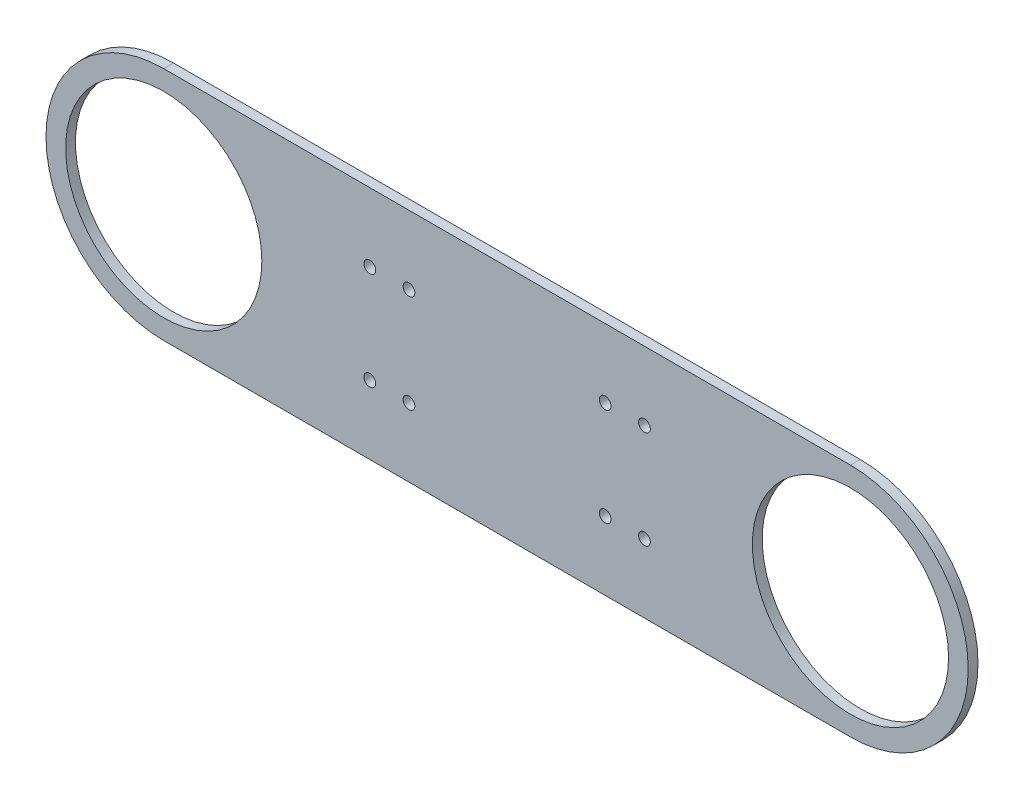
ISO-10303-21;
HEADER;
FILE_DESCRIPTION(('STEP AP214'),'2;1');
FILE_NAME('part.step','',(''),(''),'','','');
FILE_SCHEMA(('AUTOMOTIVE_DESIGN { 1 0 10303 214 1 1 1 1 }'));
ENDSEC;
DATA;
#1=APPLICATION_CONTEXT('core data for automotive mechanical design processes');
#2=APPLICATION_PROTOCOL_DEFINITION('international standard','automotive_design',2000,#1);
#3=PRODUCT_CONTEXT('',#1,'mechanical');
#4=PRODUCT('Part','Part','',(#3));
#5=PRODUCT_RELATED_PRODUCT_CATEGORY('part','',(#4));
#6=PRODUCT_DEFINITION_FORMATION('','',#4);
#7=PRODUCT_DEFINITION_CONTEXT('part definition',#1,'design');
#8=PRODUCT_DEFINITION('design','',#6,#7);
#9=PRODUCT_DEFINITION_SHAPE('','',#8);
#10=(LENGTH_UNIT() NAMED_UNIT(*) SI_UNIT(.MILLI.,.METRE.));
#11=(NAMED_UNIT(*) PLANE_ANGLE_UNIT() SI_UNIT($,.RADIAN.));
#12=(NAMED_UNIT(*) SI_UNIT($,.STERADIAN.) SOLID_ANGLE_UNIT());
#13=UNCERTAINTY_MEASURE_WITH_UNIT(LENGTH_MEASURE(1.E-05),#10,'distance_accuracy_value','');
#14=(GEOMETRIC_REPRESENTATION_CONTEXT(3) GLOBAL_UNCERTAINTY_ASSIGNED_CONTEXT((#13)) GLOBAL_UNIT_ASSIGNED_CONTEXT((#10,
#11,#12)) REPRESENTATION_CONTEXT('',''));
#15=CARTESIAN_POINT('',(0.,0.,0.));
#16=DIRECTION('',(0.,0.,1.));
#17=DIRECTION('',(1.,0.,0.));
#18=AXIS2_PLACEMENT_3D('',#15,#16,#17);
#19=CARTESIAN_POINT('',(0.,0.,-5.));
#20=DIRECTION('',(0.,0.,1.));
#21=DIRECTION('',(1.,0.,0.));
#22=AXIS2_PLACEMENT_3D('',#19,#20,#21);
#23=CYLINDRICAL_SURFACE('',#22,60.);
#24=CARTESIAN_POINT('',(0.,0.,0.));
#25=DIRECTION('',(0.,0.,1.));
#26=DIRECTION('',(1.,0.,0.));
#27=AXIS2_PLACEMENT_3D('',#24,#25,#26);
#28=CIRCLE('',#27,60.);
#29=CARTESIAN_POINT('',(0.,60.,0.));
#30=VERTEX_POINT('',#29);
#31=CARTESIAN_POINT('',(0.,-60.,0.));
#32=VERTEX_POINT('',#31);
#33=EDGE_CURVE('E106',#30,#32,#28,.T.);
#34=ORIENTED_EDGE('',*,*,#33,.F.);
#35=DIRECTION('',(0.,0.,1.));
#36=VECTOR('',#35,1.);
#37=CARTESIAN_POINT('',(0.,60.,-5.));
#38=LINE('',#37,#36);
#39=CARTESIAN_POINT('',(0.,60.,-5.));
#40=VERTEX_POINT('',#39);
#41=EDGE_CURVE('E11',#40,#30,#38,.T.);
#42=ORIENTED_EDGE('',*,*,#41,.F.);
#43=CARTESIAN_POINT('',(0.,0.,-5.));
#44=DIRECTION('',(0.,0.,1.));
#45=DIRECTION('',(1.,0.,0.));
#46=AXIS2_PLACEMENT_3D('',#43,#44,#45);
#47=CIRCLE('',#46,60.);
#48=CARTESIAN_POINT('',(0.,-60.,-5.));
#49=VERTEX_POINT('',#48);
#50=EDGE_CURVE('E99',#40,#49,#47,.T.);
#51=ORIENTED_EDGE('',*,*,#50,.T.);
#52=DIRECTION('',(0.,0.,1.));
#53=VECTOR('',#52,1.);
#54=CARTESIAN_POINT('',(0.,-60.,-5.));
#55=LINE('',#54,#53);
#56=EDGE_CURVE('E44',#49,#32,#55,.T.);
#57=ORIENTED_EDGE('',*,*,#56,.T.);
#58=EDGE_LOOP('',(#34,#42,#51,#57));
#59=FACE_BOUND('',#58,.T.);
#60=ADVANCED_FACE('F41',(#59),#23,.T.);
#61=CARTESIAN_POINT('',(0.,60.,-5.));
#62=DIRECTION('',(0.,1.,0.));
#63=DIRECTION('',(-1.,0.,0.));
#64=AXIS2_PLACEMENT_3D('',#61,#62,#63);
#65=PLANE('',#64);
#66=DIRECTION('',(-1.,0.,0.));
#67=VECTOR('',#66,1.);
#68=CARTESIAN_POINT('',(0.,60.,0.));
#69=LINE('',#68,#67);
#70=CARTESIAN_POINT('',(350.,60.,0.));
#71=VERTEX_POINT('',#70);
#72=EDGE_CURVE('E101',#71,#30,#69,.T.);
#73=ORIENTED_EDGE('',*,*,#72,.F.);
#74=DIRECTION('',(0.,0.,1.));
#75=VECTOR('',#74,1.);
#76=CARTESIAN_POINT('',(350.,60.,-5.));
#77=LINE('',#76,#75);
#78=CARTESIAN_POINT('',(350.,60.,-5.));
#79=VERTEX_POINT('',#78);
#80=EDGE_CURVE('E50',#79,#71,#77,.T.);
#81=ORIENTED_EDGE('',*,*,#80,.F.);
#82=DIRECTION('',(-1.,0.,0.));
#83=VECTOR('',#82,1.);
#84=CARTESIAN_POINT('',(0.,60.,-5.));
#85=LINE('',#84,#83);
#86=EDGE_CURVE('E96',#79,#40,#85,.T.);
#87=ORIENTED_EDGE('',*,*,#86,.T.);
#88=ORIENTED_EDGE('',*,*,#41,.T.);
#89=EDGE_LOOP('',(#73,#81,#87,#88));
#90=FACE_BOUND('',#89,.T.);
#91=ADVANCED_FACE('F117',(#90),#65,.T.);
#92=CARTESIAN_POINT('',(350.,0.,-5.));
#93=DIRECTION('',(0.,0.,1.));
#94=DIRECTION('',(1.,0.,0.));
#95=AXIS2_PLACEMENT_3D('',#92,#93,#94);
#96=CYLINDRICAL_SURFACE('',#95,60.);
#97=CARTESIAN_POINT('',(350.,0.,0.));
#98=DIRECTION('',(0.,0.,1.));
#99=DIRECTION('',(1.,0.,0.));
#100=AXIS2_PLACEMENT_3D('',#97,#98,#99);
#101=CIRCLE('',#100,60.);
#102=CARTESIAN_POINT('',(350.,-60.,0.));
#103=VERTEX_POINT('',#102);
#104=EDGE_CURVE('E91',#103,#71,#101,.T.);
#105=ORIENTED_EDGE('',*,*,#104,.F.);
#106=DIRECTION('',(0.,0.,1.));
#107=VECTOR('',#106,1.);
#108=CARTESIAN_POINT('',(350.,-60.,-5.));
#109=LINE('',#108,#107);
#110=CARTESIAN_POINT('',(350.,-60.,-5.));
#111=VERTEX_POINT('',#110);
#112=EDGE_CURVE('E86',#111,#103,#109,.T.);
#113=ORIENTED_EDGE('',*,*,#112,.F.);
#114=CARTESIAN_POINT('',(350.,0.,-5.));
#115=DIRECTION('',(0.,0.,1.));
#116=DIRECTION('',(1.,0.,0.));
#117=AXIS2_PLACEMENT_3D('',#114,#115,#116);
#118=CIRCLE('',#117,60.);
#119=EDGE_CURVE('E89',#111,#79,#118,.T.);
#120=ORIENTED_EDGE('',*,*,#119,.T.);
#121=ORIENTED_EDGE('',*,*,#80,.T.);
#122=EDGE_LOOP('',(#105,#113,#120,#121));
#123=FACE_BOUND('',#122,.T.);
#124=ADVANCED_FACE('F88',(#123),#96,.T.);
#125=CARTESIAN_POINT('',(0.,-60.,-5.));
#126=DIRECTION('',(0.,-1.,0.));
#127=DIRECTION('',(1.,0.,0.));
#128=AXIS2_PLACEMENT_3D('',#125,#126,#127);
#129=PLANE('',#128);
#130=DIRECTION('',(1.,0.,0.));
#131=VECTOR('',#130,1.);
#132=CARTESIAN_POINT('',(0.,-60.,0.));
#133=LINE('',#132,#131);
#134=EDGE_CURVE('E109',#32,#103,#133,.T.);
#135=ORIENTED_EDGE('',*,*,#134,.F.);
#136=ORIENTED_EDGE('',*,*,#56,.F.);
#137=DIRECTION('',(1.,0.,0.));
#138=VECTOR('',#137,1.);
#139=CARTESIAN_POINT('',(0.,-60.,-5.));
#140=LINE('',#139,#138);
#141=EDGE_CURVE('E95',#49,#111,#140,.T.);
#142=ORIENTED_EDGE('',*,*,#141,.T.);
#143=ORIENTED_EDGE('',*,*,#112,.T.);
#144=EDGE_LOOP('',(#135,#136,#142,#143));
#145=FACE_BOUND('',#144,.T.);
#146=ADVANCED_FACE('F98',(#145),#129,.T.);
#147=CARTESIAN_POINT('',(0.,0.,-5.));
#148=DIRECTION('',(0.,0.,1.));
#149=DIRECTION('',(1.,0.,0.));
#150=AXIS2_PLACEMENT_3D('',#147,#148,#149);
#151=PLANE('',#150);
#152=CARTESIAN_POINT('',(125.,-25.,-5.));
#153=DIRECTION('',(0.,0.,1.));
#154=DIRECTION('',(1.,0.,0.));
#155=AXIS2_PLACEMENT_3D('',#152,#153,#154);
#156=CIRCLE('',#155,2.99999999999999);
#157=CARTESIAN_POINT('',(128.,-25.,-5.));
#158=VERTEX_POINT('',#157);
#159=EDGE_CURVE('E185',#158,#158,#156,.T.);
#160=ORIENTED_EDGE('',*,*,#159,.T.);
#161=EDGE_LOOP('',(#160));
#162=FACE_BOUND('',#161,.T.);
#163=CARTESIAN_POINT('',(105.,-25.,-5.));
#164=DIRECTION('',(0.,0.,1.));
#165=DIRECTION('',(1.,0.,0.));
#166=AXIS2_PLACEMENT_3D('',#163,#164,#165);
#167=CIRCLE('',#166,2.99999999999999);
#168=CARTESIAN_POINT('',(108.,-25.,-5.));
#169=VERTEX_POINT('',#168);
#170=EDGE_CURVE('E187',#169,#169,#167,.T.);
#171=ORIENTED_EDGE('',*,*,#170,.T.);
#172=EDGE_LOOP('',(#171));
#173=FACE_BOUND('',#172,.T.);
#174=CARTESIAN_POINT('',(125.,25.,-5.));
#175=DIRECTION('',(0.,0.,1.));
#176=DIRECTION('',(1.,0.,0.));
#177=AXIS2_PLACEMENT_3D('',#174,#175,#176);
#178=CIRCLE('',#177,2.99999999999999);
#179=CARTESIAN_POINT('',(128.,25.,-5.));
#180=VERTEX_POINT('',#179);
#181=EDGE_CURVE('E201',#180,#180,#178,.F.);
#182=ORIENTED_EDGE('',*,*,#181,.F.);
#183=EDGE_LOOP('',(#182));
#184=FACE_BOUND('',#183,.T.);
#185=CARTESIAN_POINT('',(105.,25.,-5.));
#186=DIRECTION('',(0.,0.,1.));
#187=DIRECTION('',(1.,0.,0.));
#188=AXIS2_PLACEMENT_3D('',#185,#186,#187);
#189=CIRCLE('',#188,2.99999999999999);
#190=CARTESIAN_POINT('',(108.,25.,-5.));
#191=VERTEX_POINT('',#190);
#192=EDGE_CURVE('E197',#191,#191,#189,.F.);
#193=ORIENTED_EDGE('',*,*,#192,.F.);
#194=EDGE_LOOP('',(#193));
#195=FACE_BOUND('',#194,.T.);
#196=CARTESIAN_POINT('',(225.,-25.,-5.));
#197=DIRECTION('',(0.,0.,1.));
#198=DIRECTION('',(1.,0.,0.));
#199=AXIS2_PLACEMENT_3D('',#196,#197,#198);
#200=CIRCLE('',#199,2.99999999999999);
#201=CARTESIAN_POINT('',(228.,-25.,-5.));
#202=VERTEX_POINT('',#201);
#203=EDGE_CURVE('E213',#202,#202,#200,.F.);
#204=ORIENTED_EDGE('',*,*,#203,.F.);
#205=EDGE_LOOP('',(#204));
#206=FACE_BOUND('',#205,.T.);
#207=CARTESIAN_POINT('',(245.,-25.,-5.));
#208=DIRECTION('',(0.,0.,1.));
#209=DIRECTION('',(1.,0.,0.));
#210=AXIS2_PLACEMENT_3D('',#207,#208,#209);
#211=CIRCLE('',#210,2.99999999999999);
#212=CARTESIAN_POINT('',(248.,-25.,-5.));
#213=VERTEX_POINT('',#212);
#214=EDGE_CURVE('E208',#213,#213,#211,.F.);
#215=ORIENTED_EDGE('',*,*,#214,.F.);
#216=EDGE_LOOP('',(#215));
#217=FACE_BOUND('',#216,.T.);
#218=CARTESIAN_POINT('',(225.,25.,-5.));
#219=DIRECTION('',(0.,0.,1.));
#220=DIRECTION('',(1.,0.,0.));
#221=AXIS2_PLACEMENT_3D('',#218,#219,#220);
#222=CIRCLE('',#221,2.99999999999999);
#223=CARTESIAN_POINT('',(228.,25.,-5.));
#224=VERTEX_POINT('',#223);
#225=EDGE_CURVE('E225',#224,#224,#222,.T.);
#226=ORIENTED_EDGE('',*,*,#225,.T.);
#227=EDGE_LOOP('',(#226));
#228=FACE_BOUND('',#227,.T.);
#229=CARTESIAN_POINT('',(245.,25.,-5.));
#230=DIRECTION('',(0.,0.,1.));
#231=DIRECTION('',(1.,0.,0.));
#232=AXIS2_PLACEMENT_3D('',#229,#230,#231);
#233=CIRCLE('',#232,2.99999999999999);
#234=CARTESIAN_POINT('',(248.,25.,-5.));
#235=VERTEX_POINT('',#234);
#236=EDGE_CURVE('E220',#235,#235,#233,.T.);
#237=ORIENTED_EDGE('',*,*,#236,.T.);
#238=EDGE_LOOP('',(#237));
#239=FACE_BOUND('',#238,.T.);
#240=CARTESIAN_POINT('',(350.,0.,-5.));
#241=DIRECTION('',(0.,0.,1.));
#242=DIRECTION('',(1.,0.,0.));
#243=AXIS2_PLACEMENT_3D('',#240,#241,#242);
#244=CIRCLE('',#243,50.);
#245=CARTESIAN_POINT('',(400.,0.,-5.));
#246=VERTEX_POINT('',#245);
#247=EDGE_CURVE('E229',#246,#246,#244,.T.);
#248=ORIENTED_EDGE('',*,*,#247,.T.);
#249=EDGE_LOOP('',(#248));
#250=FACE_BOUND('',#249,.T.);
#251=CARTESIAN_POINT('',(0.,0.,-5.));
#252=DIRECTION('',(0.,0.,1.));
#253=DIRECTION('',(1.,0.,0.));
#254=AXIS2_PLACEMENT_3D('',#251,#252,#253);
#255=CIRCLE('',#254,50.);
#256=CARTESIAN_POINT('',(50.,0.,-5.));
#257=VERTEX_POINT('',#256);
#258=EDGE_CURVE('E110',#257,#257,#255,.T.);
#259=ORIENTED_EDGE('',*,*,#258,.T.);
#260=EDGE_LOOP('',(#259));
#261=FACE_BOUND('',#260,.T.);
#262=ORIENTED_EDGE('',*,*,#50,.F.);
#263=ORIENTED_EDGE('',*,*,#86,.F.);
#264=ORIENTED_EDGE('',*,*,#119,.F.);
#265=ORIENTED_EDGE('',*,*,#141,.F.);
#266=EDGE_LOOP('',(#262,#263,#264,#265));
#267=FACE_BOUND('',#266,.T.);
#268=ADVANCED_FACE('F94',(#162,#173,#184,#195,#206,#217,#228,#239,#250,#261,#267),#151,.F.);
#269=CARTESIAN_POINT('',(0.,0.,0.));
#270=DIRECTION('',(0.,0.,1.));
#271=DIRECTION('',(1.,0.,0.));
#272=AXIS2_PLACEMENT_3D('',#269,#270,#271);
#273=PLANE('',#272);
#274=CARTESIAN_POINT('',(125.,-25.,0.));
#275=DIRECTION('',(0.,0.,1.));
#276=DIRECTION('',(-1.,0.,0.));
#277=AXIS2_PLACEMENT_3D('',#274,#275,#276);
#278=CIRCLE('',#277,2.99999999999999);
#279=CARTESIAN_POINT('',(122.,-25.,0.));
#280=VERTEX_POINT('',#279);
#281=EDGE_CURVE('E183',#280,#280,#278,.T.);
#282=ORIENTED_EDGE('',*,*,#281,.F.);
#283=EDGE_LOOP('',(#282));
#284=FACE_BOUND('',#283,.T.);
#285=CARTESIAN_POINT('',(105.,-25.,0.));
#286=DIRECTION('',(0.,0.,1.));
#287=DIRECTION('',(-1.,0.,0.));
#288=AXIS2_PLACEMENT_3D('',#285,#286,#287);
#289=CIRCLE('',#288,2.99999999999999);
#290=CARTESIAN_POINT('',(102.,-25.,0.));
#291=VERTEX_POINT('',#290);
#292=EDGE_CURVE('E277',#291,#291,#289,.T.);
#293=ORIENTED_EDGE('',*,*,#292,.F.);
#294=EDGE_LOOP('',(#293));
#295=FACE_BOUND('',#294,.T.);
#296=CARTESIAN_POINT('',(125.,25.,0.));
#297=DIRECTION('',(0.,0.,-1.));
#298=DIRECTION('',(-1.,0.,0.));
#299=AXIS2_PLACEMENT_3D('',#296,#297,#298);
#300=CIRCLE('',#299,2.99999999999999);
#301=CARTESIAN_POINT('',(122.,25.,0.));
#302=VERTEX_POINT('',#301);
#303=EDGE_CURVE('E190',#302,#302,#300,.T.);
#304=ORIENTED_EDGE('',*,*,#303,.T.);
#305=EDGE_LOOP('',(#304));
#306=FACE_BOUND('',#305,.T.);
#307=CARTESIAN_POINT('',(105.,25.,0.));
#308=DIRECTION('',(0.,0.,-1.));
#309=DIRECTION('',(-1.,0.,0.));
#310=AXIS2_PLACEMENT_3D('',#307,#308,#309);
#311=CIRCLE('',#310,2.99999999999999);
#312=CARTESIAN_POINT('',(102.,25.,0.));
#313=VERTEX_POINT('',#312);
#314=EDGE_CURVE('E186',#313,#313,#311,.T.);
#315=ORIENTED_EDGE('',*,*,#314,.T.);
#316=EDGE_LOOP('',(#315));
#317=FACE_BOUND('',#316,.T.);
#318=CARTESIAN_POINT('',(225.,-25.,0.));
#319=DIRECTION('',(0.,0.,-1.));
#320=DIRECTION('',(1.,0.,0.));
#321=AXIS2_PLACEMENT_3D('',#318,#319,#320);
#322=CIRCLE('',#321,2.99999999999999);
#323=CARTESIAN_POINT('',(228.,-25.,0.));
#324=VERTEX_POINT('',#323);
#325=EDGE_CURVE('E205',#324,#324,#322,.T.);
#326=ORIENTED_EDGE('',*,*,#325,.T.);
#327=EDGE_LOOP('',(#326));
#328=FACE_BOUND('',#327,.T.);
#329=CARTESIAN_POINT('',(245.,-25.,0.));
#330=DIRECTION('',(0.,0.,-1.));
#331=DIRECTION('',(1.,0.,0.));
#332=AXIS2_PLACEMENT_3D('',#329,#330,#331);
#333=CIRCLE('',#332,2.99999999999999);
#334=CARTESIAN_POINT('',(248.,-25.,0.));
#335=VERTEX_POINT('',#334);
#336=EDGE_CURVE('E204',#335,#335,#333,.T.);
#337=ORIENTED_EDGE('',*,*,#336,.T.);
#338=EDGE_LOOP('',(#337));
#339=FACE_BOUND('',#338,.T.);
#340=CARTESIAN_POINT('',(225.,25.,0.));
#341=DIRECTION('',(0.,0.,1.));
#342=DIRECTION('',(1.,0.,0.));
#343=AXIS2_PLACEMENT_3D('',#340,#341,#342);
#344=CIRCLE('',#343,2.99999999999999);
#345=CARTESIAN_POINT('',(228.,25.,0.));
#346=VERTEX_POINT('',#345);
#347=EDGE_CURVE('E217',#346,#346,#344,.T.);
#348=ORIENTED_EDGE('',*,*,#347,.F.);
#349=EDGE_LOOP('',(#348));
#350=FACE_BOUND('',#349,.T.);
#351=CARTESIAN_POINT('',(245.,25.,0.));
#352=DIRECTION('',(0.,0.,1.));
#353=DIRECTION('',(1.,0.,0.));
#354=AXIS2_PLACEMENT_3D('',#351,#352,#353);
#355=CIRCLE('',#354,2.99999999999999);
#356=CARTESIAN_POINT('',(248.,25.,0.));
#357=VERTEX_POINT('',#356);
#358=EDGE_CURVE('E216',#357,#357,#355,.T.);
#359=ORIENTED_EDGE('',*,*,#358,.F.);
#360=EDGE_LOOP('',(#359));
#361=FACE_BOUND('',#360,.T.);
#362=CARTESIAN_POINT('',(350.,0.,0.));
#363=DIRECTION('',(0.,0.,1.));
#364=DIRECTION('',(1.,0.,0.));
#365=AXIS2_PLACEMENT_3D('',#362,#363,#364);
#366=CIRCLE('',#365,50.);
#367=CARTESIAN_POINT('',(400.,0.,0.));
#368=VERTEX_POINT('',#367);
#369=EDGE_CURVE('E228',#368,#368,#366,.T.);
#370=ORIENTED_EDGE('',*,*,#369,.F.);
#371=EDGE_LOOP('',(#370));
#372=FACE_BOUND('',#371,.T.);
#373=CARTESIAN_POINT('',(0.,0.,0.));
#374=DIRECTION('',(0.,0.,1.));
#375=DIRECTION('',(1.,0.,0.));
#376=AXIS2_PLACEMENT_3D('',#373,#374,#375);
#377=CIRCLE('',#376,50.);
#378=CARTESIAN_POINT('',(50.,0.,0.));
#379=VERTEX_POINT('',#378);
#380=EDGE_CURVE('E232',#379,#379,#377,.T.);
#381=ORIENTED_EDGE('',*,*,#380,.F.);
#382=EDGE_LOOP('',(#381));
#383=FACE_BOUND('',#382,.T.);
#384=ORIENTED_EDGE('',*,*,#33,.T.);
#385=ORIENTED_EDGE('',*,*,#134,.T.);
#386=ORIENTED_EDGE('',*,*,#104,.T.);
#387=ORIENTED_EDGE('',*,*,#72,.T.);
#388=EDGE_LOOP('',(#384,#385,#386,#387));
#389=FACE_BOUND('',#388,.T.);
#390=ADVANCED_FACE('F116',(#284,#295,#306,#317,#328,#339,#350,#361,#372,#383,#389),#273,.T.);
#391=CARTESIAN_POINT('',(0.,0.,-5.));
#392=DIRECTION('',(0.,0.,1.));
#393=DIRECTION('',(1.,0.,0.));
#394=AXIS2_PLACEMENT_3D('',#391,#392,#393);
#395=CYLINDRICAL_SURFACE('',#394,50.);
#396=ORIENTED_EDGE('',*,*,#258,.F.);
#397=EDGE_LOOP('',(#396));
#398=FACE_BOUND('',#397,.T.);
#399=ORIENTED_EDGE('',*,*,#380,.T.);
#400=EDGE_LOOP('',(#399));
#401=FACE_BOUND('',#400,.T.);
#402=ADVANCED_FACE('F135',(#398,#401),#395,.F.);
#403=CARTESIAN_POINT('',(350.,0.,-5.));
#404=DIRECTION('',(0.,0.,1.));
#405=DIRECTION('',(1.,0.,0.));
#406=AXIS2_PLACEMENT_3D('',#403,#404,#405);
#407=CYLINDRICAL_SURFACE('',#406,50.);
#408=ORIENTED_EDGE('',*,*,#247,.F.);
#409=EDGE_LOOP('',(#408));
#410=FACE_BOUND('',#409,.T.);
#411=ORIENTED_EDGE('',*,*,#369,.T.);
#412=EDGE_LOOP('',(#411));
#413=FACE_BOUND('',#412,.T.);
#414=ADVANCED_FACE('F142',(#410,#413),#407,.F.);
#415=CARTESIAN_POINT('',(245.,25.,-10.));
#416=DIRECTION('',(0.,0.,1.));
#417=DIRECTION('',(1.,0.,0.));
#418=AXIS2_PLACEMENT_3D('',#415,#416,#417);
#419=CYLINDRICAL_SURFACE('',#418,2.99999999999999);
#420=ORIENTED_EDGE('',*,*,#358,.T.);
#421=EDGE_LOOP('',(#420));
#422=FACE_BOUND('',#421,.T.);
#423=ORIENTED_EDGE('',*,*,#236,.F.);
#424=EDGE_LOOP('',(#423));
#425=FACE_BOUND('',#424,.T.);
#426=ADVANCED_FACE('F146',(#422,#425),#419,.F.);
#427=CARTESIAN_POINT('',(225.,25.,-10.));
#428=DIRECTION('',(0.,0.,1.));
#429=DIRECTION('',(1.,0.,0.));
#430=AXIS2_PLACEMENT_3D('',#427,#428,#429);
#431=CYLINDRICAL_SURFACE('',#430,2.99999999999999);
#432=ORIENTED_EDGE('',*,*,#347,.T.);
#433=EDGE_LOOP('',(#432));
#434=FACE_BOUND('',#433,.T.);
#435=ORIENTED_EDGE('',*,*,#225,.F.);
#436=EDGE_LOOP('',(#435));
#437=FACE_BOUND('',#436,.T.);
#438=ADVANCED_FACE('F150',(#434,#437),#431,.F.);
#439=CARTESIAN_POINT('',(245.,-25.,-10.));
#440=DIRECTION('',(0.,0.,1.));
#441=DIRECTION('',(1.,0.,0.));
#442=AXIS2_PLACEMENT_3D('',#439,#440,#441);
#443=CYLINDRICAL_SURFACE('',#442,2.99999999999999);
#444=ORIENTED_EDGE('',*,*,#336,.F.);
#445=EDGE_LOOP('',(#444));
#446=FACE_BOUND('',#445,.T.);
#447=ORIENTED_EDGE('',*,*,#214,.T.);
#448=EDGE_LOOP('',(#447));
#449=FACE_BOUND('',#448,.T.);
#450=ADVANCED_FACE('F154',(#446,#449),#443,.F.);
#451=CARTESIAN_POINT('',(225.,-25.,-10.));
#452=DIRECTION('',(0.,0.,1.));
#453=DIRECTION('',(1.,0.,0.));
#454=AXIS2_PLACEMENT_3D('',#451,#452,#453);
#455=CYLINDRICAL_SURFACE('',#454,2.99999999999999);
#456=ORIENTED_EDGE('',*,*,#325,.F.);
#457=EDGE_LOOP('',(#456));
#458=FACE_BOUND('',#457,.T.);
#459=ORIENTED_EDGE('',*,*,#203,.T.);
#460=EDGE_LOOP('',(#459));
#461=FACE_BOUND('',#460,.T.);
#462=ADVANCED_FACE('F158',(#458,#461),#455,.F.);
#463=CARTESIAN_POINT('',(105.,25.,-10.));
#464=DIRECTION('',(0.,0.,1.));
#465=DIRECTION('',(1.,0.,0.));
#466=AXIS2_PLACEMENT_3D('',#463,#464,#465);
#467=CYLINDRICAL_SURFACE('',#466,2.99999999999999);
#468=ORIENTED_EDGE('',*,*,#314,.F.);
#469=EDGE_LOOP('',(#468));
#470=FACE_BOUND('',#469,.T.);
#471=ORIENTED_EDGE('',*,*,#192,.T.);
#472=EDGE_LOOP('',(#471));
#473=FACE_BOUND('',#472,.T.);
#474=ADVANCED_FACE('F162',(#470,#473),#467,.F.);
#475=CARTESIAN_POINT('',(125.,25.,-10.));
#476=DIRECTION('',(0.,0.,1.));
#477=DIRECTION('',(1.,0.,0.));
#478=AXIS2_PLACEMENT_3D('',#475,#476,#477);
#479=CYLINDRICAL_SURFACE('',#478,2.99999999999999);
#480=ORIENTED_EDGE('',*,*,#303,.F.);
#481=EDGE_LOOP('',(#480));
#482=FACE_BOUND('',#481,.T.);
#483=ORIENTED_EDGE('',*,*,#181,.T.);
#484=EDGE_LOOP('',(#483));
#485=FACE_BOUND('',#484,.T.);
#486=ADVANCED_FACE('F166',(#482,#485),#479,.F.);
#487=CARTESIAN_POINT('',(105.,-25.,-10.));
#488=DIRECTION('',(0.,0.,1.));
#489=DIRECTION('',(1.,0.,0.));
#490=AXIS2_PLACEMENT_3D('',#487,#488,#489);
#491=CYLINDRICAL_SURFACE('',#490,2.99999999999999);
#492=ORIENTED_EDGE('',*,*,#292,.T.);
#493=EDGE_LOOP('',(#492));
#494=FACE_BOUND('',#493,.T.);
#495=ORIENTED_EDGE('',*,*,#170,.F.);
#496=EDGE_LOOP('',(#495));
#497=FACE_BOUND('',#496,.T.);
#498=ADVANCED_FACE('F170',(#494,#497),#491,.F.);
#499=CARTESIAN_POINT('',(125.,-25.,-10.));
#500=DIRECTION('',(0.,0.,1.));
#501=DIRECTION('',(1.,0.,0.));
#502=AXIS2_PLACEMENT_3D('',#499,#500,#501);
#503=CYLINDRICAL_SURFACE('',#502,2.99999999999999);
#504=ORIENTED_EDGE('',*,*,#281,.T.);
#505=EDGE_LOOP('',(#504));
#506=FACE_BOUND('',#505,.T.);
#507=ORIENTED_EDGE('',*,*,#159,.F.);
#508=EDGE_LOOP('',(#507));
#509=FACE_BOUND('',#508,.T.);
#510=ADVANCED_FACE('F174',(#506,#509),#503,.F.);
#511=CLOSED_SHELL('',(#60,#91,#124,#146,#268,#390,#402,#414,#426,#438,#450,#462,#474,#486,#498,#510));
#512=MANIFOLD_SOLID_BREP('B2',#511);
#513=ADVANCED_BREP_SHAPE_REPRESENTATION('',(#18,#512),#14);
#514=SHAPE_DEFINITION_REPRESENTATION(#9,#513);
ENDSEC;
END-ISO-10303-21;
